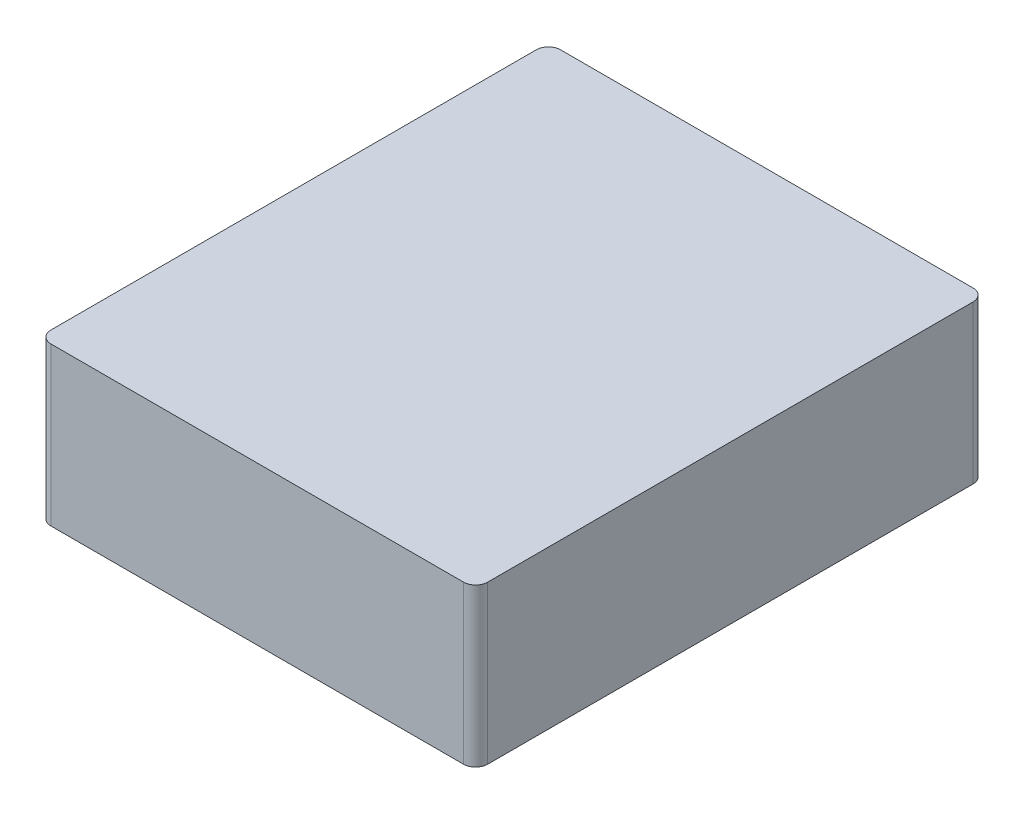
ISO-10303-21;
HEADER;
FILE_DESCRIPTION(('STEP AP214'),'2;1');
FILE_NAME('part.step','',(''),(''),'','','');
FILE_SCHEMA(('AUTOMOTIVE_DESIGN { 1 0 10303 214 1 1 1 1 }'));
ENDSEC;
DATA;
#1=APPLICATION_CONTEXT('core data for automotive mechanical design processes');
#2=APPLICATION_PROTOCOL_DEFINITION('international standard','automotive_design',2000,#1);
#3=PRODUCT_CONTEXT('',#1,'mechanical');
#4=PRODUCT('Part','Part','',(#3));
#5=PRODUCT_RELATED_PRODUCT_CATEGORY('part','',(#4));
#6=PRODUCT_DEFINITION_FORMATION('','',#4);
#7=PRODUCT_DEFINITION_CONTEXT('part definition',#1,'design');
#8=PRODUCT_DEFINITION('design','',#6,#7);
#9=PRODUCT_DEFINITION_SHAPE('','',#8);
#10=(LENGTH_UNIT() NAMED_UNIT(*) SI_UNIT(.MILLI.,.METRE.));
#11=(NAMED_UNIT(*) PLANE_ANGLE_UNIT() SI_UNIT($,.RADIAN.));
#12=(NAMED_UNIT(*) SI_UNIT($,.STERADIAN.) SOLID_ANGLE_UNIT());
#13=UNCERTAINTY_MEASURE_WITH_UNIT(LENGTH_MEASURE(1.E-05),#10,'distance_accuracy_value','');
#14=(GEOMETRIC_REPRESENTATION_CONTEXT(3) GLOBAL_UNCERTAINTY_ASSIGNED_CONTEXT((#13)) GLOBAL_UNIT_ASSIGNED_CONTEXT((#10,
#11,#12)) REPRESENTATION_CONTEXT('',''));
#15=CARTESIAN_POINT('',(0.,0.,0.));
#16=DIRECTION('',(0.,0.,1.));
#17=DIRECTION('',(1.,0.,0.));
#18=AXIS2_PLACEMENT_3D('',#15,#16,#17);
#19=CARTESIAN_POINT('',(18.,13.,21.));
#20=DIRECTION('',(-1.,0.,0.));
#21=DIRECTION('',(0.,0.,1.));
#22=AXIS2_PLACEMENT_3D('',#19,#20,#21);
#23=PLANE('',#22);
#24=DIRECTION('',(0.,0.,-1.));
#25=VECTOR('',#24,1.);
#26=CARTESIAN_POINT('',(18.,0.,21.));
#27=LINE('',#26,#25);
#28=CARTESIAN_POINT('',(18.,0.,20.));
#29=VERTEX_POINT('',#28);
#30=CARTESIAN_POINT('',(18.,0.,-20.));
#31=VERTEX_POINT('',#30);
#32=EDGE_CURVE('E156',#29,#31,#27,.T.);
#33=ORIENTED_EDGE('',*,*,#32,.T.);
#34=DIRECTION('',(0.,-1.,0.));
#35=VECTOR('',#34,1.);
#36=CARTESIAN_POINT('',(18.,13.,-20.));
#37=LINE('',#36,#35);
#38=CARTESIAN_POINT('',(18.,13.,-20.));
#39=VERTEX_POINT('',#38);
#40=EDGE_CURVE('E11',#31,#39,#37,.F.);
#41=ORIENTED_EDGE('',*,*,#40,.T.);
#42=DIRECTION('',(0.,0.,-1.));
#43=VECTOR('',#42,1.);
#44=CARTESIAN_POINT('',(18.,13.,21.));
#45=LINE('',#44,#43);
#46=CARTESIAN_POINT('',(18.,13.,20.));
#47=VERTEX_POINT('',#46);
#48=EDGE_CURVE('E124',#47,#39,#45,.T.);
#49=ORIENTED_EDGE('',*,*,#48,.F.);
#50=DIRECTION('',(0.,-1.,0.));
#51=VECTOR('',#50,1.);
#52=CARTESIAN_POINT('',(18.,13.,20.));
#53=LINE('',#52,#51);
#54=EDGE_CURVE('E40',#47,#29,#53,.T.);
#55=ORIENTED_EDGE('',*,*,#54,.T.);
#56=EDGE_LOOP('',(#33,#41,#49,#55));
#57=FACE_BOUND('',#56,.T.);
#58=ADVANCED_FACE('F32',(#57),#23,.F.);
#59=CARTESIAN_POINT('',(-18.,13.,-21.));
#60=DIRECTION('',(0.,0.,1.));
#61=DIRECTION('',(1.,0.,0.));
#62=AXIS2_PLACEMENT_3D('',#59,#60,#61);
#63=PLANE('',#62);
#64=DIRECTION('',(-1.,0.,0.));
#65=VECTOR('',#64,1.);
#66=CARTESIAN_POINT('',(-18.,0.,-21.));
#67=LINE('',#66,#65);
#68=CARTESIAN_POINT('',(17.,0.,-21.));
#69=VERTEX_POINT('',#68);
#70=CARTESIAN_POINT('',(-17.,0.,-21.));
#71=VERTEX_POINT('',#70);
#72=EDGE_CURVE('E129',#69,#71,#67,.T.);
#73=ORIENTED_EDGE('',*,*,#72,.T.);
#74=DIRECTION('',(0.,-1.,0.));
#75=VECTOR('',#74,1.);
#76=CARTESIAN_POINT('',(-17.,13.,-21.));
#77=LINE('',#76,#75);
#78=CARTESIAN_POINT('',(-17.,13.,-21.));
#79=VERTEX_POINT('',#78);
#80=EDGE_CURVE('E47',#71,#79,#77,.F.);
#81=ORIENTED_EDGE('',*,*,#80,.T.);
#82=DIRECTION('',(-1.,0.,0.));
#83=VECTOR('',#82,1.);
#84=CARTESIAN_POINT('',(-18.,13.,-21.));
#85=LINE('',#84,#83);
#86=CARTESIAN_POINT('',(17.,13.,-21.));
#87=VERTEX_POINT('',#86);
#88=EDGE_CURVE('E127',#87,#79,#85,.T.);
#89=ORIENTED_EDGE('',*,*,#88,.F.);
#90=DIRECTION('',(0.,-1.,0.));
#91=VECTOR('',#90,1.);
#92=CARTESIAN_POINT('',(17.,13.,-21.));
#93=LINE('',#92,#91);
#94=EDGE_CURVE('E148',#87,#69,#93,.T.);
#95=ORIENTED_EDGE('',*,*,#94,.T.);
#96=EDGE_LOOP('',(#73,#81,#89,#95));
#97=FACE_BOUND('',#96,.T.);
#98=ADVANCED_FACE('F176',(#97),#63,.F.);
#99=CARTESIAN_POINT('',(-18.,13.,21.));
#100=DIRECTION('',(1.,0.,0.));
#101=DIRECTION('',(0.,0.,-1.));
#102=AXIS2_PLACEMENT_3D('',#99,#100,#101);
#103=PLANE('',#102);
#104=DIRECTION('',(0.,0.,1.));
#105=VECTOR('',#104,1.);
#106=CARTESIAN_POINT('',(-18.,0.,21.));
#107=LINE('',#106,#105);
#108=CARTESIAN_POINT('',(-18.,0.,-20.));
#109=VERTEX_POINT('',#108);
#110=CARTESIAN_POINT('',(-18.,0.,20.));
#111=VERTEX_POINT('',#110);
#112=EDGE_CURVE('E125',#109,#111,#107,.T.);
#113=ORIENTED_EDGE('',*,*,#112,.T.);
#114=DIRECTION('',(0.,-1.,0.));
#115=VECTOR('',#114,1.);
#116=CARTESIAN_POINT('',(-18.,13.,20.));
#117=LINE('',#116,#115);
#118=CARTESIAN_POINT('',(-18.,13.,20.));
#119=VERTEX_POINT('',#118);
#120=EDGE_CURVE('E103',#111,#119,#117,.F.);
#121=ORIENTED_EDGE('',*,*,#120,.T.);
#122=DIRECTION('',(0.,0.,1.));
#123=VECTOR('',#122,1.);
#124=CARTESIAN_POINT('',(-18.,13.,21.));
#125=LINE('',#124,#123);
#126=CARTESIAN_POINT('',(-18.,13.,-20.));
#127=VERTEX_POINT('',#126);
#128=EDGE_CURVE('E164',#127,#119,#125,.T.);
#129=ORIENTED_EDGE('',*,*,#128,.F.);
#130=DIRECTION('',(0.,-1.,0.));
#131=VECTOR('',#130,1.);
#132=CARTESIAN_POINT('',(-18.,13.,-20.));
#133=LINE('',#132,#131);
#134=EDGE_CURVE('E108',#127,#109,#133,.T.);
#135=ORIENTED_EDGE('',*,*,#134,.T.);
#136=EDGE_LOOP('',(#113,#121,#129,#135));
#137=FACE_BOUND('',#136,.T.);
#138=ADVANCED_FACE('F175',(#137),#103,.F.);
#139=CARTESIAN_POINT('',(-18.,13.,21.));
#140=DIRECTION('',(0.,0.,-1.));
#141=DIRECTION('',(-1.,0.,0.));
#142=AXIS2_PLACEMENT_3D('',#139,#140,#141);
#143=PLANE('',#142);
#144=DIRECTION('',(1.,0.,0.));
#145=VECTOR('',#144,1.);
#146=CARTESIAN_POINT('',(-18.,13.,21.));
#147=LINE('',#146,#145);
#148=CARTESIAN_POINT('',(-17.,13.,21.));
#149=VERTEX_POINT('',#148);
#150=CARTESIAN_POINT('',(17.,13.,21.));
#151=VERTEX_POINT('',#150);
#152=EDGE_CURVE('E118',#149,#151,#147,.T.);
#153=ORIENTED_EDGE('',*,*,#152,.F.);
#154=DIRECTION('',(0.,-1.,0.));
#155=VECTOR('',#154,1.);
#156=CARTESIAN_POINT('',(-17.,13.,21.));
#157=LINE('',#156,#155);
#158=CARTESIAN_POINT('',(-17.,0.,21.));
#159=VERTEX_POINT('',#158);
#160=EDGE_CURVE('E102',#149,#159,#157,.T.);
#161=ORIENTED_EDGE('',*,*,#160,.T.);
#162=DIRECTION('',(1.,0.,0.));
#163=VECTOR('',#162,1.);
#164=CARTESIAN_POINT('',(-18.,0.,21.));
#165=LINE('',#164,#163);
#166=CARTESIAN_POINT('',(17.,0.,21.));
#167=VERTEX_POINT('',#166);
#168=EDGE_CURVE('E115',#159,#167,#165,.T.);
#169=ORIENTED_EDGE('',*,*,#168,.T.);
#170=DIRECTION('',(0.,-1.,0.));
#171=VECTOR('',#170,1.);
#172=CARTESIAN_POINT('',(17.,13.,21.));
#173=LINE('',#172,#171);
#174=EDGE_CURVE('E120',#167,#151,#173,.F.);
#175=ORIENTED_EDGE('',*,*,#174,.T.);
#176=EDGE_LOOP('',(#153,#161,#169,#175));
#177=FACE_BOUND('',#176,.T.);
#178=ADVANCED_FACE('F114',(#177),#143,.F.);
#179=CARTESIAN_POINT('',(0.,13.,0.));
#180=DIRECTION('',(0.,-1.,0.));
#181=DIRECTION('',(0.,0.,-1.));
#182=AXIS2_PLACEMENT_3D('',#179,#180,#181);
#183=PLANE('',#182);
#184=ORIENTED_EDGE('',*,*,#128,.T.);
#185=CARTESIAN_POINT('',(-17.,13.,20.));
#186=DIRECTION('',(0.,-1.,0.));
#187=DIRECTION('',(0.,0.,-1.));
#188=AXIS2_PLACEMENT_3D('',#185,#186,#187);
#189=CIRCLE('',#188,1.);
#190=EDGE_CURVE('E146',#119,#149,#189,.F.);
#191=ORIENTED_EDGE('',*,*,#190,.T.);
#192=ORIENTED_EDGE('',*,*,#152,.T.);
#193=CARTESIAN_POINT('',(17.,13.,20.));
#194=DIRECTION('',(0.,-1.,0.));
#195=DIRECTION('',(0.,0.,-1.));
#196=AXIS2_PLACEMENT_3D('',#193,#194,#195);
#197=CIRCLE('',#196,1.);
#198=EDGE_CURVE('E141',#151,#47,#197,.F.);
#199=ORIENTED_EDGE('',*,*,#198,.T.);
#200=ORIENTED_EDGE('',*,*,#48,.T.);
#201=CARTESIAN_POINT('',(17.,13.,-20.));
#202=DIRECTION('',(0.,-1.,0.));
#203=DIRECTION('',(0.,0.,-1.));
#204=AXIS2_PLACEMENT_3D('',#201,#202,#203);
#205=CIRCLE('',#204,1.);
#206=EDGE_CURVE('E54',#39,#87,#205,.F.);
#207=ORIENTED_EDGE('',*,*,#206,.T.);
#208=ORIENTED_EDGE('',*,*,#88,.T.);
#209=CARTESIAN_POINT('',(-17.,13.,-20.));
#210=DIRECTION('',(0.,-1.,0.));
#211=DIRECTION('',(0.,0.,-1.));
#212=AXIS2_PLACEMENT_3D('',#209,#210,#211);
#213=CIRCLE('',#212,1.);
#214=EDGE_CURVE('E144',#79,#127,#213,.F.);
#215=ORIENTED_EDGE('',*,*,#214,.T.);
#216=EDGE_LOOP('',(#184,#191,#192,#199,#200,#207,#208,#215));
#217=FACE_BOUND('',#216,.T.);
#218=ADVANCED_FACE('F168',(#217),#183,.F.);
#219=CARTESIAN_POINT('',(0.,0.,0.));
#220=DIRECTION('',(0.,-1.,0.));
#221=DIRECTION('',(0.,0.,-1.));
#222=AXIS2_PLACEMENT_3D('',#219,#220,#221);
#223=PLANE('',#222);
#224=ORIENTED_EDGE('',*,*,#168,.F.);
#225=CARTESIAN_POINT('',(-17.,0.,20.));
#226=DIRECTION('',(0.,-1.,0.));
#227=DIRECTION('',(0.,0.,-1.));
#228=AXIS2_PLACEMENT_3D('',#225,#226,#227);
#229=CIRCLE('',#228,1.);
#230=EDGE_CURVE('E98',#159,#111,#229,.T.);
#231=ORIENTED_EDGE('',*,*,#230,.T.);
#232=ORIENTED_EDGE('',*,*,#112,.F.);
#233=CARTESIAN_POINT('',(-17.,0.,-20.));
#234=DIRECTION('',(0.,-1.,0.));
#235=DIRECTION('',(0.,0.,-1.));
#236=AXIS2_PLACEMENT_3D('',#233,#234,#235);
#237=CIRCLE('',#236,1.);
#238=EDGE_CURVE('E109',#109,#71,#237,.T.);
#239=ORIENTED_EDGE('',*,*,#238,.T.);
#240=ORIENTED_EDGE('',*,*,#72,.F.);
#241=CARTESIAN_POINT('',(17.,0.,-20.));
#242=DIRECTION('',(0.,-1.,0.));
#243=DIRECTION('',(0.,0.,-1.));
#244=AXIS2_PLACEMENT_3D('',#241,#242,#243);
#245=CIRCLE('',#244,1.);
#246=EDGE_CURVE('E135',#69,#31,#245,.T.);
#247=ORIENTED_EDGE('',*,*,#246,.T.);
#248=ORIENTED_EDGE('',*,*,#32,.F.);
#249=CARTESIAN_POINT('',(17.,0.,20.));
#250=DIRECTION('',(0.,-1.,0.));
#251=DIRECTION('',(0.,0.,-1.));
#252=AXIS2_PLACEMENT_3D('',#249,#250,#251);
#253=CIRCLE('',#252,1.);
#254=EDGE_CURVE('E119',#29,#167,#253,.T.);
#255=ORIENTED_EDGE('',*,*,#254,.T.);
#256=EDGE_LOOP('',(#224,#231,#232,#239,#240,#247,#248,#255));
#257=FACE_BOUND('',#256,.T.);
#258=ADVANCED_FACE('F122',(#257),#223,.T.);
#259=CARTESIAN_POINT('',(-17.,13.,20.));
#260=DIRECTION('',(0.,-1.,0.));
#261=DIRECTION('',(0.,0.,-1.));
#262=AXIS2_PLACEMENT_3D('',#259,#260,#261);
#263=CYLINDRICAL_SURFACE('',#262,1.);
#264=ORIENTED_EDGE('',*,*,#190,.F.);
#265=ORIENTED_EDGE('',*,*,#120,.F.);
#266=ORIENTED_EDGE('',*,*,#230,.F.);
#267=ORIENTED_EDGE('',*,*,#160,.F.);
#268=EDGE_LOOP('',(#264,#265,#266,#267));
#269=FACE_BOUND('',#268,.T.);
#270=ADVANCED_FACE('F101',(#269),#263,.T.);
#271=CARTESIAN_POINT('',(-17.,13.,-20.));
#272=DIRECTION('',(0.,-1.,0.));
#273=DIRECTION('',(0.,0.,-1.));
#274=AXIS2_PLACEMENT_3D('',#271,#272,#273);
#275=CYLINDRICAL_SURFACE('',#274,1.);
#276=ORIENTED_EDGE('',*,*,#214,.F.);
#277=ORIENTED_EDGE('',*,*,#80,.F.);
#278=ORIENTED_EDGE('',*,*,#238,.F.);
#279=ORIENTED_EDGE('',*,*,#134,.F.);
#280=EDGE_LOOP('',(#276,#277,#278,#279));
#281=FACE_BOUND('',#280,.T.);
#282=ADVANCED_FACE('F173',(#281),#275,.T.);
#283=CARTESIAN_POINT('',(17.,13.,-20.));
#284=DIRECTION('',(0.,-1.,0.));
#285=DIRECTION('',(0.,0.,-1.));
#286=AXIS2_PLACEMENT_3D('',#283,#284,#285);
#287=CYLINDRICAL_SURFACE('',#286,1.);
#288=ORIENTED_EDGE('',*,*,#206,.F.);
#289=ORIENTED_EDGE('',*,*,#40,.F.);
#290=ORIENTED_EDGE('',*,*,#246,.F.);
#291=ORIENTED_EDGE('',*,*,#94,.F.);
#292=EDGE_LOOP('',(#288,#289,#290,#291));
#293=FACE_BOUND('',#292,.T.);
#294=ADVANCED_FACE('F178',(#293),#287,.T.);
#295=CARTESIAN_POINT('',(17.,13.,20.));
#296=DIRECTION('',(0.,-1.,0.));
#297=DIRECTION('',(0.,0.,-1.));
#298=AXIS2_PLACEMENT_3D('',#295,#296,#297);
#299=CYLINDRICAL_SURFACE('',#298,1.);
#300=ORIENTED_EDGE('',*,*,#198,.F.);
#301=ORIENTED_EDGE('',*,*,#174,.F.);
#302=ORIENTED_EDGE('',*,*,#254,.F.);
#303=ORIENTED_EDGE('',*,*,#54,.F.);
#304=EDGE_LOOP('',(#300,#301,#302,#303));
#305=FACE_BOUND('',#304,.T.);
#306=ADVANCED_FACE('F34',(#305),#299,.T.);
#307=CLOSED_SHELL('',(#58,#98,#138,#178,#218,#258,#270,#282,#294,#306));
#308=MANIFOLD_SOLID_BREP('B2',#307);
#309=ADVANCED_BREP_SHAPE_REPRESENTATION('',(#18,#308),#14);
#310=SHAPE_DEFINITION_REPRESENTATION(#9,#309);
ENDSEC;
END-ISO-10303-21;
